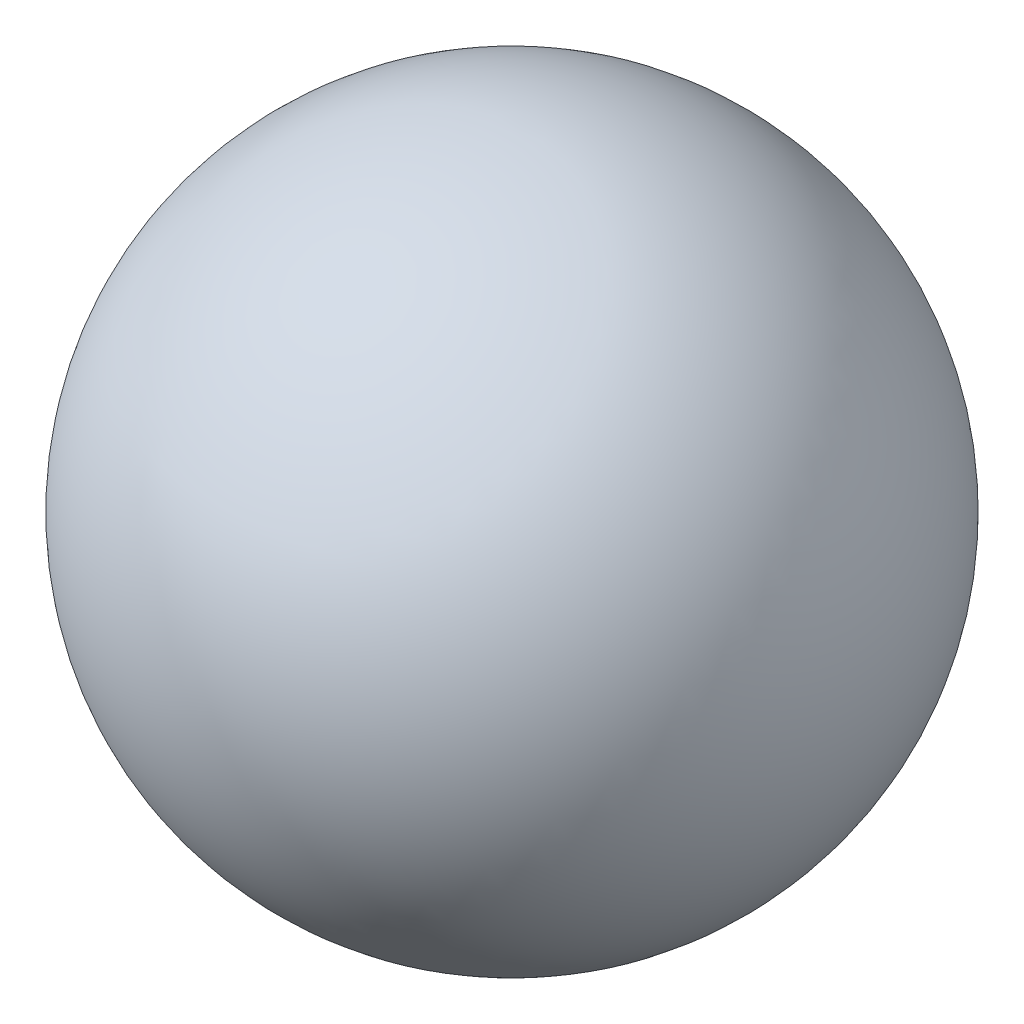
ISO-10303-21;
HEADER;
FILE_DESCRIPTION(('STEP AP214'),'2;1');
FILE_NAME('part.step','',(''),(''),'','','');
FILE_SCHEMA(('AUTOMOTIVE_DESIGN { 1 0 10303 214 1 1 1 1 }'));
ENDSEC;
DATA;
#1=APPLICATION_CONTEXT('core data for automotive mechanical design processes');
#2=APPLICATION_PROTOCOL_DEFINITION('international standard','automotive_design',2000,#1);
#3=PRODUCT_CONTEXT('',#1,'mechanical');
#4=PRODUCT('Part','Part','',(#3));
#5=PRODUCT_RELATED_PRODUCT_CATEGORY('part','',(#4));
#6=PRODUCT_DEFINITION_FORMATION('','',#4);
#7=PRODUCT_DEFINITION_CONTEXT('part definition',#1,'design');
#8=PRODUCT_DEFINITION('design','',#6,#7);
#9=PRODUCT_DEFINITION_SHAPE('','',#8);
#10=(LENGTH_UNIT() NAMED_UNIT(*) SI_UNIT(.MILLI.,.METRE.));
#11=(NAMED_UNIT(*) PLANE_ANGLE_UNIT() SI_UNIT($,.RADIAN.));
#12=(NAMED_UNIT(*) SI_UNIT($,.STERADIAN.) SOLID_ANGLE_UNIT());
#13=UNCERTAINTY_MEASURE_WITH_UNIT(LENGTH_MEASURE(1.E-05),#10,'distance_accuracy_value','');
#14=(GEOMETRIC_REPRESENTATION_CONTEXT(3) GLOBAL_UNCERTAINTY_ASSIGNED_CONTEXT((#13)) GLOBAL_UNIT_ASSIGNED_CONTEXT((#10,
#11,#12)) REPRESENTATION_CONTEXT('',''));
#15=CARTESIAN_POINT('',(0.,0.,0.));
#16=DIRECTION('',(0.,0.,1.));
#17=DIRECTION('',(1.,0.,0.));
#18=AXIS2_PLACEMENT_3D('',#15,#16,#17);
#19=CARTESIAN_POINT('',(0.,50.,0.));
#20=DIRECTION('',(0.,-1.,0.));
#21=DIRECTION('',(-1.,0.,0.));
#22=AXIS2_PLACEMENT_3D('',#19,#20,#21);
#23=SPHERICAL_SURFACE('',#22,50.);
#24=CARTESIAN_POINT('',(0.,0.,0.));
#25=VERTEX_POINT('',#24);
#26=VERTEX_LOOP('',#25);
#27=FACE_BOUND('',#26,.T.);
#28=ADVANCED_FACE('F35',(#27),#23,.T.);
#29=CLOSED_SHELL('',(#28));
#30=MANIFOLD_SOLID_BREP('B2',#29);
#31=ADVANCED_BREP_SHAPE_REPRESENTATION('',(#18,#30),#14);
#32=SHAPE_DEFINITION_REPRESENTATION(#9,#31);
ENDSEC;
END-ISO-10303-21;
